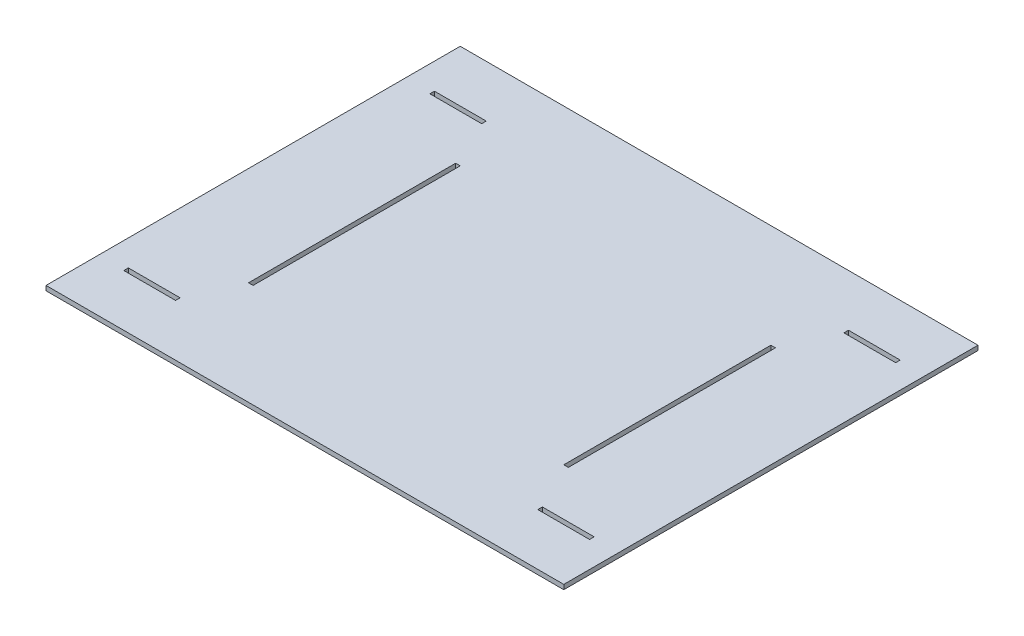
ISO-10303-21;
HEADER;
FILE_DESCRIPTION(('STEP AP214'),'2;1');
FILE_NAME('part.step','',(''),(''),'','','');
FILE_SCHEMA(('AUTOMOTIVE_DESIGN { 1 0 10303 214 1 1 1 1 }'));
ENDSEC;
DATA;
#1=APPLICATION_CONTEXT('core data for automotive mechanical design processes');
#2=APPLICATION_PROTOCOL_DEFINITION('international standard','automotive_design',2000,#1);
#3=PRODUCT_CONTEXT('',#1,'mechanical');
#4=PRODUCT('Part','Part','',(#3));
#5=PRODUCT_RELATED_PRODUCT_CATEGORY('part','',(#4));
#6=PRODUCT_DEFINITION_FORMATION('','',#4);
#7=PRODUCT_DEFINITION_CONTEXT('part definition',#1,'design');
#8=PRODUCT_DEFINITION('design','',#6,#7);
#9=PRODUCT_DEFINITION_SHAPE('','',#8);
#10=(LENGTH_UNIT() NAMED_UNIT(*) SI_UNIT(.MILLI.,.METRE.));
#11=(NAMED_UNIT(*) PLANE_ANGLE_UNIT() SI_UNIT($,.RADIAN.));
#12=(NAMED_UNIT(*) SI_UNIT($,.STERADIAN.) SOLID_ANGLE_UNIT());
#13=UNCERTAINTY_MEASURE_WITH_UNIT(LENGTH_MEASURE(1.E-05),#10,'distance_accuracy_value','');
#14=(GEOMETRIC_REPRESENTATION_CONTEXT(3) GLOBAL_UNCERTAINTY_ASSIGNED_CONTEXT((#13)) GLOBAL_UNIT_ASSIGNED_CONTEXT((#10,
#11,#12)) REPRESENTATION_CONTEXT('',''));
#15=CARTESIAN_POINT('',(0.,0.,0.));
#16=DIRECTION('',(0.,0.,1.));
#17=DIRECTION('',(1.,0.,0.));
#18=AXIS2_PLACEMENT_3D('',#15,#16,#17);
#19=CARTESIAN_POINT('',(-250.,4.5,-200.));
#20=DIRECTION('',(0.,0.,-1.));
#21=DIRECTION('',(-1.,0.,0.));
#22=AXIS2_PLACEMENT_3D('',#19,#20,#21);
#23=PLANE('',#22);
#24=DIRECTION('',(1.,0.,0.));
#25=VECTOR('',#24,1.);
#26=CARTESIAN_POINT('',(-250.,0.,-200.));
#27=LINE('',#26,#25);
#28=CARTESIAN_POINT('',(-250.,0.,-200.));
#29=VERTEX_POINT('',#28);
#30=CARTESIAN_POINT('',(250.,0.,-200.));
#31=VERTEX_POINT('',#30);
#32=EDGE_CURVE('E459',#29,#31,#27,.T.);
#33=ORIENTED_EDGE('',*,*,#32,.F.);
#34=DIRECTION('',(0.,-1.,0.));
#35=VECTOR('',#34,1.);
#36=CARTESIAN_POINT('',(-250.,4.5,-200.));
#37=LINE('',#36,#35);
#38=CARTESIAN_POINT('',(-250.,4.5,-200.));
#39=VERTEX_POINT('',#38);
#40=EDGE_CURVE('E11',#39,#29,#37,.T.);
#41=ORIENTED_EDGE('',*,*,#40,.F.);
#42=DIRECTION('',(1.,0.,0.));
#43=VECTOR('',#42,1.);
#44=CARTESIAN_POINT('',(-250.,4.5,-200.));
#45=LINE('',#44,#43);
#46=CARTESIAN_POINT('',(250.,4.5,-200.));
#47=VERTEX_POINT('',#46);
#48=EDGE_CURVE('E482',#39,#47,#45,.T.);
#49=ORIENTED_EDGE('',*,*,#48,.T.);
#50=DIRECTION('',(0.,-1.,0.));
#51=VECTOR('',#50,1.);
#52=CARTESIAN_POINT('',(250.,4.5,-200.));
#53=LINE('',#52,#51);
#54=EDGE_CURVE('E46',#47,#31,#53,.T.);
#55=ORIENTED_EDGE('',*,*,#54,.T.);
#56=EDGE_LOOP('',(#33,#41,#49,#55));
#57=FACE_BOUND('',#56,.T.);
#58=ADVANCED_FACE('F43',(#57),#23,.T.);
#59=CARTESIAN_POINT('',(-250.,4.5,-200.));
#60=DIRECTION('',(1.,0.,0.));
#61=DIRECTION('',(0.,0.,-1.));
#62=AXIS2_PLACEMENT_3D('',#59,#60,#61);
#63=PLANE('',#62);
#64=DIRECTION('',(0.,0.,1.));
#65=VECTOR('',#64,1.);
#66=CARTESIAN_POINT('',(-250.,0.,-200.));
#67=LINE('',#66,#65);
#68=CARTESIAN_POINT('',(-250.,0.,200.));
#69=VERTEX_POINT('',#68);
#70=EDGE_CURVE('E487',#29,#69,#67,.T.);
#71=ORIENTED_EDGE('',*,*,#70,.T.);
#72=DIRECTION('',(0.,-1.,0.));
#73=VECTOR('',#72,1.);
#74=CARTESIAN_POINT('',(-250.,4.5,200.));
#75=LINE('',#74,#73);
#76=CARTESIAN_POINT('',(-250.,4.5,200.));
#77=VERTEX_POINT('',#76);
#78=EDGE_CURVE('E52',#77,#69,#75,.T.);
#79=ORIENTED_EDGE('',*,*,#78,.F.);
#80=DIRECTION('',(0.,0.,1.));
#81=VECTOR('',#80,1.);
#82=CARTESIAN_POINT('',(-250.,4.5,-200.));
#83=LINE('',#82,#81);
#84=EDGE_CURVE('E494',#39,#77,#83,.T.);
#85=ORIENTED_EDGE('',*,*,#84,.F.);
#86=ORIENTED_EDGE('',*,*,#40,.T.);
#87=EDGE_LOOP('',(#71,#79,#85,#86));
#88=FACE_BOUND('',#87,.T.);
#89=ADVANCED_FACE('F529',(#88),#63,.F.);
#90=CARTESIAN_POINT('',(-250.,4.5,200.));
#91=DIRECTION('',(0.,0.,-1.));
#92=DIRECTION('',(-1.,0.,0.));
#93=AXIS2_PLACEMENT_3D('',#90,#91,#92);
#94=PLANE('',#93);
#95=DIRECTION('',(1.,0.,0.));
#96=VECTOR('',#95,1.);
#97=CARTESIAN_POINT('',(-250.,0.,200.));
#98=LINE('',#97,#96);
#99=CARTESIAN_POINT('',(250.,0.,200.));
#100=VERTEX_POINT('',#99);
#101=EDGE_CURVE('E504',#69,#100,#98,.T.);
#102=ORIENTED_EDGE('',*,*,#101,.T.);
#103=DIRECTION('',(0.,-1.,0.));
#104=VECTOR('',#103,1.);
#105=CARTESIAN_POINT('',(250.,4.5,200.));
#106=LINE('',#105,#104);
#107=CARTESIAN_POINT('',(250.,4.5,200.));
#108=VERTEX_POINT('',#107);
#109=EDGE_CURVE('E512',#108,#100,#106,.T.);
#110=ORIENTED_EDGE('',*,*,#109,.F.);
#111=DIRECTION('',(1.,0.,0.));
#112=VECTOR('',#111,1.);
#113=CARTESIAN_POINT('',(-250.,4.5,200.));
#114=LINE('',#113,#112);
#115=EDGE_CURVE('E491',#77,#108,#114,.T.);
#116=ORIENTED_EDGE('',*,*,#115,.F.);
#117=ORIENTED_EDGE('',*,*,#78,.T.);
#118=EDGE_LOOP('',(#102,#110,#116,#117));
#119=FACE_BOUND('',#118,.T.);
#120=ADVANCED_FACE('F533',(#119),#94,.F.);
#121=CARTESIAN_POINT('',(250.,4.5,-200.));
#122=DIRECTION('',(1.,0.,0.));
#123=DIRECTION('',(0.,0.,-1.));
#124=AXIS2_PLACEMENT_3D('',#121,#122,#123);
#125=PLANE('',#124);
#126=DIRECTION('',(0.,0.,1.));
#127=VECTOR('',#126,1.);
#128=CARTESIAN_POINT('',(250.,0.,-200.));
#129=LINE('',#128,#127);
#130=EDGE_CURVE('E500',#31,#100,#129,.T.);
#131=ORIENTED_EDGE('',*,*,#130,.F.);
#132=ORIENTED_EDGE('',*,*,#54,.F.);
#133=DIRECTION('',(0.,0.,1.));
#134=VECTOR('',#133,1.);
#135=CARTESIAN_POINT('',(250.,4.5,-200.));
#136=LINE('',#135,#134);
#137=EDGE_CURVE('E486',#47,#108,#136,.T.);
#138=ORIENTED_EDGE('',*,*,#137,.T.);
#139=ORIENTED_EDGE('',*,*,#109,.T.);
#140=EDGE_LOOP('',(#131,#132,#138,#139));
#141=FACE_BOUND('',#140,.T.);
#142=ADVANCED_FACE('F522',(#141),#125,.T.);
#143=CARTESIAN_POINT('',(0.,4.5,0.));
#144=DIRECTION('',(0.,-1.,0.));
#145=DIRECTION('',(0.,0.,-1.));
#146=AXIS2_PLACEMENT_3D('',#143,#144,#145);
#147=PLANE('',#146);
#148=DIRECTION('',(0.,0.,-1.));
#149=VECTOR('',#148,1.);
#150=CARTESIAN_POINT('',(224.9,4.5,150.));
#151=LINE('',#150,#149);
#152=CARTESIAN_POINT('',(224.9,4.5,150.));
#153=VERTEX_POINT('',#152);
#154=CARTESIAN_POINT('',(224.9,4.5,145.6));
#155=VERTEX_POINT('',#154);
#156=EDGE_CURVE('E250',#153,#155,#151,.T.);
#157=ORIENTED_EDGE('',*,*,#156,.F.);
#158=DIRECTION('',(1.,0.,0.));
#159=VECTOR('',#158,1.);
#160=CARTESIAN_POINT('',(224.9,4.5,150.));
#161=LINE('',#160,#159);
#162=CARTESIAN_POINT('',(174.9,4.5,150.));
#163=VERTEX_POINT('',#162);
#164=EDGE_CURVE('E242',#163,#153,#161,.T.);
#165=ORIENTED_EDGE('',*,*,#164,.F.);
#166=DIRECTION('',(0.,0.,1.));
#167=VECTOR('',#166,1.);
#168=CARTESIAN_POINT('',(174.9,4.5,150.));
#169=LINE('',#168,#167);
#170=CARTESIAN_POINT('',(174.9,4.5,145.6));
#171=VERTEX_POINT('',#170);
#172=EDGE_CURVE('E230',#171,#163,#169,.T.);
#173=ORIENTED_EDGE('',*,*,#172,.F.);
#174=DIRECTION('',(-1.,0.,0.));
#175=VECTOR('',#174,1.);
#176=CARTESIAN_POINT('',(224.9,4.5,145.6));
#177=LINE('',#176,#175);
#178=EDGE_CURVE('E60',#155,#171,#177,.T.);
#179=ORIENTED_EDGE('',*,*,#178,.F.);
#180=EDGE_LOOP('',(#157,#165,#173,#179));
#181=FACE_BOUND('',#180,.T.);
#182=DIRECTION('',(0.,0.,1.));
#183=VECTOR('',#182,1.);
#184=CARTESIAN_POINT('',(-174.9,4.5,150.));
#185=LINE('',#184,#183);
#186=CARTESIAN_POINT('',(-174.9,4.5,145.6));
#187=VERTEX_POINT('',#186);
#188=CARTESIAN_POINT('',(-174.9,4.5,150.));
#189=VERTEX_POINT('',#188);
#190=EDGE_CURVE('E256',#187,#189,#185,.T.);
#191=ORIENTED_EDGE('',*,*,#190,.T.);
#192=DIRECTION('',(-1.,0.,0.));
#193=VECTOR('',#192,1.);
#194=CARTESIAN_POINT('',(-224.9,4.5,150.));
#195=LINE('',#194,#193);
#196=CARTESIAN_POINT('',(-224.9,4.5,150.));
#197=VERTEX_POINT('',#196);
#198=EDGE_CURVE('E297',#189,#197,#195,.T.);
#199=ORIENTED_EDGE('',*,*,#198,.T.);
#200=DIRECTION('',(0.,0.,-1.));
#201=VECTOR('',#200,1.);
#202=CARTESIAN_POINT('',(-224.9,4.5,150.));
#203=LINE('',#202,#201);
#204=CARTESIAN_POINT('',(-224.9,4.5,145.6));
#205=VERTEX_POINT('',#204);
#206=EDGE_CURVE('E289',#197,#205,#203,.T.);
#207=ORIENTED_EDGE('',*,*,#206,.T.);
#208=DIRECTION('',(1.,0.,0.));
#209=VECTOR('',#208,1.);
#210=CARTESIAN_POINT('',(-224.9,4.5,145.6));
#211=LINE('',#210,#209);
#212=EDGE_CURVE('E279',#205,#187,#211,.T.);
#213=ORIENTED_EDGE('',*,*,#212,.T.);
#214=EDGE_LOOP('',(#191,#199,#207,#213));
#215=FACE_BOUND('',#214,.T.);
#216=DIRECTION('',(0.,0.,-1.));
#217=VECTOR('',#216,1.);
#218=CARTESIAN_POINT('',(174.9,4.5,-150.));
#219=LINE('',#218,#217);
#220=CARTESIAN_POINT('',(174.9,4.5,-145.6));
#221=VERTEX_POINT('',#220);
#222=CARTESIAN_POINT('',(174.9,4.5,-150.));
#223=VERTEX_POINT('',#222);
#224=EDGE_CURVE('E305',#221,#223,#219,.T.);
#225=ORIENTED_EDGE('',*,*,#224,.T.);
#226=DIRECTION('',(1.,0.,0.));
#227=VECTOR('',#226,1.);
#228=CARTESIAN_POINT('',(224.9,4.5,-150.));
#229=LINE('',#228,#227);
#230=CARTESIAN_POINT('',(224.9,4.5,-150.));
#231=VERTEX_POINT('',#230);
#232=EDGE_CURVE('E341',#223,#231,#229,.T.);
#233=ORIENTED_EDGE('',*,*,#232,.T.);
#234=DIRECTION('',(0.,0.,1.));
#235=VECTOR('',#234,1.);
#236=CARTESIAN_POINT('',(224.9,4.5,-150.));
#237=LINE('',#236,#235);
#238=CARTESIAN_POINT('',(224.9,4.5,-145.6));
#239=VERTEX_POINT('',#238);
#240=EDGE_CURVE('E333',#231,#239,#237,.T.);
#241=ORIENTED_EDGE('',*,*,#240,.T.);
#242=DIRECTION('',(-1.,0.,0.));
#243=VECTOR('',#242,1.);
#244=CARTESIAN_POINT('',(224.9,4.5,-145.6));
#245=LINE('',#244,#243);
#246=EDGE_CURVE('E323',#239,#221,#245,.T.);
#247=ORIENTED_EDGE('',*,*,#246,.T.);
#248=EDGE_LOOP('',(#225,#233,#241,#247));
#249=FACE_BOUND('',#248,.T.);
#250=DIRECTION('',(0.,0.,1.));
#251=VECTOR('',#250,1.);
#252=CARTESIAN_POINT('',(-224.9,4.5,-150.));
#253=LINE('',#252,#251);
#254=CARTESIAN_POINT('',(-224.9,4.5,-150.));
#255=VERTEX_POINT('',#254);
#256=CARTESIAN_POINT('',(-224.9,4.5,-145.6));
#257=VERTEX_POINT('',#256);
#258=EDGE_CURVE('E354',#255,#257,#253,.T.);
#259=ORIENTED_EDGE('',*,*,#258,.F.);
#260=DIRECTION('',(-1.,0.,0.));
#261=VECTOR('',#260,1.);
#262=CARTESIAN_POINT('',(-224.9,4.5,-150.));
#263=LINE('',#262,#261);
#264=CARTESIAN_POINT('',(-174.9,4.5,-150.));
#265=VERTEX_POINT('',#264);
#266=EDGE_CURVE('E358',#265,#255,#263,.T.);
#267=ORIENTED_EDGE('',*,*,#266,.F.);
#268=DIRECTION('',(0.,0.,-1.));
#269=VECTOR('',#268,1.);
#270=CARTESIAN_POINT('',(-174.9,4.5,-150.));
#271=LINE('',#270,#269);
#272=CARTESIAN_POINT('',(-174.9,4.5,-145.6));
#273=VERTEX_POINT('',#272);
#274=EDGE_CURVE('E349',#273,#265,#271,.T.);
#275=ORIENTED_EDGE('',*,*,#274,.F.);
#276=DIRECTION('',(1.,0.,0.));
#277=VECTOR('',#276,1.);
#278=CARTESIAN_POINT('',(-224.9,4.5,-145.6));
#279=LINE('',#278,#277);
#280=EDGE_CURVE('E350',#257,#273,#279,.T.);
#281=ORIENTED_EDGE('',*,*,#280,.F.);
#282=EDGE_LOOP('',(#259,#267,#275,#281));
#283=FACE_BOUND('',#282,.T.);
#284=DIRECTION('',(-1.,0.,1.1985362197658E-13));
#285=VECTOR('',#284,1.);
#286=CARTESIAN_POINT('',(154.4,4.5,-100.));
#287=LINE('',#286,#285);
#288=CARTESIAN_POINT('',(154.4,4.5,-100.));
#289=VERTEX_POINT('',#288);
#290=CARTESIAN_POINT('',(150.,4.5,-99.9999999999995));
#291=VERTEX_POINT('',#290);
#292=EDGE_CURVE('E397',#289,#291,#287,.T.);
#293=ORIENTED_EDGE('',*,*,#292,.F.);
#294=DIRECTION('',(0.,0.,1.));
#295=VECTOR('',#294,1.);
#296=CARTESIAN_POINT('',(154.4,4.5,-100.));
#297=LINE('',#296,#295);
#298=CARTESIAN_POINT('',(154.4,4.5,100.));
#299=VERTEX_POINT('',#298);
#300=EDGE_CURVE('E430',#289,#299,#297,.T.);
#301=ORIENTED_EDGE('',*,*,#300,.T.);
#302=DIRECTION('',(-1.,0.,1.1985362197658E-13));
#303=VECTOR('',#302,1.);
#304=CARTESIAN_POINT('',(154.4,4.5,100.));
#305=LINE('',#304,#303);
#306=CARTESIAN_POINT('',(150.,4.5,100.000000000001));
#307=VERTEX_POINT('',#306);
#308=EDGE_CURVE('E422',#299,#307,#305,.T.);
#309=ORIENTED_EDGE('',*,*,#308,.T.);
#310=DIRECTION('',(0.,0.,1.));
#311=VECTOR('',#310,1.);
#312=CARTESIAN_POINT('',(150.,4.5,-99.9999999999995));
#313=LINE('',#312,#311);
#314=EDGE_CURVE('E415',#291,#307,#313,.T.);
#315=ORIENTED_EDGE('',*,*,#314,.F.);
#316=EDGE_LOOP('',(#293,#301,#309,#315));
#317=FACE_BOUND('',#316,.T.);
#318=DIRECTION('',(1.,0.,1.1985362197658E-13));
#319=VECTOR('',#318,1.);
#320=CARTESIAN_POINT('',(-154.4,4.5,100.));
#321=LINE('',#320,#319);
#322=CARTESIAN_POINT('',(-154.4,4.5,100.));
#323=VERTEX_POINT('',#322);
#324=CARTESIAN_POINT('',(-150.,4.5,100.000000000001));
#325=VERTEX_POINT('',#324);
#326=EDGE_CURVE('E443',#323,#325,#321,.T.);
#327=ORIENTED_EDGE('',*,*,#326,.F.);
#328=DIRECTION('',(0.,0.,1.));
#329=VECTOR('',#328,1.);
#330=CARTESIAN_POINT('',(-154.4,4.5,-100.));
#331=LINE('',#330,#329);
#332=CARTESIAN_POINT('',(-154.4,4.5,-100.));
#333=VERTEX_POINT('',#332);
#334=EDGE_CURVE('E439',#333,#323,#331,.T.);
#335=ORIENTED_EDGE('',*,*,#334,.F.);
#336=DIRECTION('',(1.,0.,1.1985362197658E-13));
#337=VECTOR('',#336,1.);
#338=CARTESIAN_POINT('',(-154.4,4.5,-100.));
#339=LINE('',#338,#337);
#340=CARTESIAN_POINT('',(-150.,4.5,-99.9999999999995));
#341=VERTEX_POINT('',#340);
#342=EDGE_CURVE('E455',#333,#341,#339,.T.);
#343=ORIENTED_EDGE('',*,*,#342,.T.);
#344=DIRECTION('',(0.,0.,1.));
#345=VECTOR('',#344,1.);
#346=CARTESIAN_POINT('',(-150.,4.5,-99.9999999999995));
#347=LINE('',#346,#345);
#348=EDGE_CURVE('E449',#341,#325,#347,.T.);
#349=ORIENTED_EDGE('',*,*,#348,.T.);
#350=EDGE_LOOP('',(#327,#335,#343,#349));
#351=FACE_BOUND('',#350,.T.);
#352=ORIENTED_EDGE('',*,*,#48,.F.);
#353=ORIENTED_EDGE('',*,*,#84,.T.);
#354=ORIENTED_EDGE('',*,*,#115,.T.);
#355=ORIENTED_EDGE('',*,*,#137,.F.);
#356=EDGE_LOOP('',(#352,#353,#354,#355));
#357=FACE_BOUND('',#356,.T.);
#358=ADVANCED_FACE('F247',(#181,#215,#249,#283,#317,#351,#357),#147,.F.);
#359=CARTESIAN_POINT('',(0.,0.,0.));
#360=DIRECTION('',(0.,-1.,0.));
#361=DIRECTION('',(0.,0.,-1.));
#362=AXIS2_PLACEMENT_3D('',#359,#360,#361);
#363=PLANE('',#362);
#364=DIRECTION('',(1.,0.,0.));
#365=VECTOR('',#364,1.);
#366=CARTESIAN_POINT('',(224.9,0.,150.));
#367=LINE('',#366,#365);
#368=CARTESIAN_POINT('',(174.9,0.,150.));
#369=VERTEX_POINT('',#368);
#370=CARTESIAN_POINT('',(224.9,0.,150.));
#371=VERTEX_POINT('',#370);
#372=EDGE_CURVE('E68',#369,#371,#367,.T.);
#373=ORIENTED_EDGE('',*,*,#372,.T.);
#374=DIRECTION('',(0.,0.,-1.));
#375=VECTOR('',#374,1.);
#376=CARTESIAN_POINT('',(224.9,0.,150.));
#377=LINE('',#376,#375);
#378=CARTESIAN_POINT('',(224.9,0.,145.6));
#379=VERTEX_POINT('',#378);
#380=EDGE_CURVE('E252',#371,#379,#377,.T.);
#381=ORIENTED_EDGE('',*,*,#380,.T.);
#382=DIRECTION('',(-1.,0.,0.));
#383=VECTOR('',#382,1.);
#384=CARTESIAN_POINT('',(224.9,0.,145.6));
#385=LINE('',#384,#383);
#386=CARTESIAN_POINT('',(174.9,0.,145.6));
#387=VERTEX_POINT('',#386);
#388=EDGE_CURVE('E879',#379,#387,#385,.T.);
#389=ORIENTED_EDGE('',*,*,#388,.T.);
#390=DIRECTION('',(0.,0.,1.));
#391=VECTOR('',#390,1.);
#392=CARTESIAN_POINT('',(174.9,0.,150.));
#393=LINE('',#392,#391);
#394=EDGE_CURVE('E238',#387,#369,#393,.T.);
#395=ORIENTED_EDGE('',*,*,#394,.T.);
#396=EDGE_LOOP('',(#373,#381,#389,#395));
#397=FACE_BOUND('',#396,.T.);
#398=DIRECTION('',(-1.,0.,0.));
#399=VECTOR('',#398,1.);
#400=CARTESIAN_POINT('',(-224.9,0.,150.));
#401=LINE('',#400,#399);
#402=CARTESIAN_POINT('',(-174.9,0.,150.));
#403=VERTEX_POINT('',#402);
#404=CARTESIAN_POINT('',(-224.9,0.,150.));
#405=VERTEX_POINT('',#404);
#406=EDGE_CURVE('E301',#403,#405,#401,.T.);
#407=ORIENTED_EDGE('',*,*,#406,.F.);
#408=DIRECTION('',(0.,0.,1.));
#409=VECTOR('',#408,1.);
#410=CARTESIAN_POINT('',(-174.9,0.,150.));
#411=LINE('',#410,#409);
#412=CARTESIAN_POINT('',(-174.9,0.,145.6));
#413=VERTEX_POINT('',#412);
#414=EDGE_CURVE('E265',#413,#403,#411,.T.);
#415=ORIENTED_EDGE('',*,*,#414,.F.);
#416=DIRECTION('',(1.,0.,0.));
#417=VECTOR('',#416,1.);
#418=CARTESIAN_POINT('',(-224.9,0.,145.6));
#419=LINE('',#418,#417);
#420=CARTESIAN_POINT('',(-224.9,0.,145.6));
#421=VERTEX_POINT('',#420);
#422=EDGE_CURVE('E283',#421,#413,#419,.T.);
#423=ORIENTED_EDGE('',*,*,#422,.F.);
#424=DIRECTION('',(0.,0.,-1.));
#425=VECTOR('',#424,1.);
#426=CARTESIAN_POINT('',(-224.9,0.,150.));
#427=LINE('',#426,#425);
#428=EDGE_CURVE('E293',#405,#421,#427,.T.);
#429=ORIENTED_EDGE('',*,*,#428,.F.);
#430=EDGE_LOOP('',(#407,#415,#423,#429));
#431=FACE_BOUND('',#430,.T.);
#432=DIRECTION('',(1.,0.,0.));
#433=VECTOR('',#432,1.);
#434=CARTESIAN_POINT('',(224.9,0.,-150.));
#435=LINE('',#434,#433);
#436=CARTESIAN_POINT('',(174.9,0.,-150.));
#437=VERTEX_POINT('',#436);
#438=CARTESIAN_POINT('',(224.9,0.,-150.));
#439=VERTEX_POINT('',#438);
#440=EDGE_CURVE('E345',#437,#439,#435,.T.);
#441=ORIENTED_EDGE('',*,*,#440,.F.);
#442=DIRECTION('',(0.,0.,-1.));
#443=VECTOR('',#442,1.);
#444=CARTESIAN_POINT('',(174.9,0.,-150.));
#445=LINE('',#444,#443);
#446=CARTESIAN_POINT('',(174.9,0.,-145.6));
#447=VERTEX_POINT('',#446);
#448=EDGE_CURVE('E309',#447,#437,#445,.T.);
#449=ORIENTED_EDGE('',*,*,#448,.F.);
#450=DIRECTION('',(-1.,0.,0.));
#451=VECTOR('',#450,1.);
#452=CARTESIAN_POINT('',(224.9,0.,-145.6));
#453=LINE('',#452,#451);
#454=CARTESIAN_POINT('',(224.9,0.,-145.6));
#455=VERTEX_POINT('',#454);
#456=EDGE_CURVE('E327',#455,#447,#453,.T.);
#457=ORIENTED_EDGE('',*,*,#456,.F.);
#458=DIRECTION('',(0.,0.,1.));
#459=VECTOR('',#458,1.);
#460=CARTESIAN_POINT('',(224.9,0.,-150.));
#461=LINE('',#460,#459);
#462=EDGE_CURVE('E337',#439,#455,#461,.T.);
#463=ORIENTED_EDGE('',*,*,#462,.F.);
#464=EDGE_LOOP('',(#441,#449,#457,#463));
#465=FACE_BOUND('',#464,.T.);
#466=DIRECTION('',(-1.,0.,0.));
#467=VECTOR('',#466,1.);
#468=CARTESIAN_POINT('',(-224.9,0.,-150.));
#469=LINE('',#468,#467);
#470=CARTESIAN_POINT('',(-174.9,0.,-150.));
#471=VERTEX_POINT('',#470);
#472=CARTESIAN_POINT('',(-224.9,0.,-150.));
#473=VERTEX_POINT('',#472);
#474=EDGE_CURVE('E353',#471,#473,#469,.T.);
#475=ORIENTED_EDGE('',*,*,#474,.T.);
#476=DIRECTION('',(0.,0.,1.));
#477=VECTOR('',#476,1.);
#478=CARTESIAN_POINT('',(-224.9,0.,-150.));
#479=LINE('',#478,#477);
#480=CARTESIAN_POINT('',(-224.9,0.,-145.6));
#481=VERTEX_POINT('',#480);
#482=EDGE_CURVE('E380',#473,#481,#479,.T.);
#483=ORIENTED_EDGE('',*,*,#482,.T.);
#484=DIRECTION('',(1.,0.,0.));
#485=VECTOR('',#484,1.);
#486=CARTESIAN_POINT('',(-224.9,0.,-145.6));
#487=LINE('',#486,#485);
#488=CARTESIAN_POINT('',(-174.9,0.,-145.6));
#489=VERTEX_POINT('',#488);
#490=EDGE_CURVE('E375',#481,#489,#487,.T.);
#491=ORIENTED_EDGE('',*,*,#490,.T.);
#492=DIRECTION('',(0.,0.,-1.));
#493=VECTOR('',#492,1.);
#494=CARTESIAN_POINT('',(-174.9,0.,-150.));
#495=LINE('',#494,#493);
#496=EDGE_CURVE('E369',#489,#471,#495,.T.);
#497=ORIENTED_EDGE('',*,*,#496,.T.);
#498=EDGE_LOOP('',(#475,#483,#491,#497));
#499=FACE_BOUND('',#498,.T.);
#500=DIRECTION('',(0.,0.,1.));
#501=VECTOR('',#500,1.);
#502=CARTESIAN_POINT('',(154.4,0.,-100.));
#503=LINE('',#502,#501);
#504=CARTESIAN_POINT('',(154.4,0.,-100.));
#505=VERTEX_POINT('',#504);
#506=CARTESIAN_POINT('',(154.4,0.,100.));
#507=VERTEX_POINT('',#506);
#508=EDGE_CURVE('E434',#505,#507,#503,.T.);
#509=ORIENTED_EDGE('',*,*,#508,.F.);
#510=DIRECTION('',(-1.,0.,1.1985362197658E-13));
#511=VECTOR('',#510,1.);
#512=CARTESIAN_POINT('',(154.4,0.,-100.));
#513=LINE('',#512,#511);
#514=CARTESIAN_POINT('',(150.,0.,-99.9999999999995));
#515=VERTEX_POINT('',#514);
#516=EDGE_CURVE('E393',#505,#515,#513,.T.);
#517=ORIENTED_EDGE('',*,*,#516,.T.);
#518=DIRECTION('',(0.,0.,1.));
#519=VECTOR('',#518,1.);
#520=CARTESIAN_POINT('',(150.,0.,-99.9999999999995));
#521=LINE('',#520,#519);
#522=CARTESIAN_POINT('',(150.,0.,100.000000000001));
#523=VERTEX_POINT('',#522);
#524=EDGE_CURVE('E408',#515,#523,#521,.T.);
#525=ORIENTED_EDGE('',*,*,#524,.T.);
#526=DIRECTION('',(-1.,0.,1.1985362197658E-13));
#527=VECTOR('',#526,1.);
#528=CARTESIAN_POINT('',(154.4,0.,100.));
#529=LINE('',#528,#527);
#530=EDGE_CURVE('E426',#507,#523,#529,.T.);
#531=ORIENTED_EDGE('',*,*,#530,.F.);
#532=EDGE_LOOP('',(#509,#517,#525,#531));
#533=FACE_BOUND('',#532,.T.);
#534=DIRECTION('',(0.,0.,1.));
#535=VECTOR('',#534,1.);
#536=CARTESIAN_POINT('',(-154.4,0.,-100.));
#537=LINE('',#536,#535);
#538=CARTESIAN_POINT('',(-154.4,0.,-100.));
#539=VERTEX_POINT('',#538);
#540=CARTESIAN_POINT('',(-154.4,0.,100.));
#541=VERTEX_POINT('',#540);
#542=EDGE_CURVE('E448',#539,#541,#537,.T.);
#543=ORIENTED_EDGE('',*,*,#542,.T.);
#544=DIRECTION('',(1.,0.,1.1985362197658E-13));
#545=VECTOR('',#544,1.);
#546=CARTESIAN_POINT('',(-154.4,0.,100.));
#547=LINE('',#546,#545);
#548=CARTESIAN_POINT('',(-150.,0.,100.000000000001));
#549=VERTEX_POINT('',#548);
#550=EDGE_CURVE('E468',#541,#549,#547,.T.);
#551=ORIENTED_EDGE('',*,*,#550,.T.);
#552=DIRECTION('',(0.,0.,1.));
#553=VECTOR('',#552,1.);
#554=CARTESIAN_POINT('',(-150.,0.,-99.9999999999995));
#555=LINE('',#554,#553);
#556=CARTESIAN_POINT('',(-150.,0.,-99.9999999999995));
#557=VERTEX_POINT('',#556);
#558=EDGE_CURVE('E444',#557,#549,#555,.T.);
#559=ORIENTED_EDGE('',*,*,#558,.F.);
#560=DIRECTION('',(1.,0.,1.1985362197658E-13));
#561=VECTOR('',#560,1.);
#562=CARTESIAN_POINT('',(-154.4,0.,-100.));
#563=LINE('',#562,#561);
#564=EDGE_CURVE('E438',#539,#557,#563,.T.);
#565=ORIENTED_EDGE('',*,*,#564,.F.);
#566=EDGE_LOOP('',(#543,#551,#559,#565));
#567=FACE_BOUND('',#566,.T.);
#568=ORIENTED_EDGE('',*,*,#32,.T.);
#569=ORIENTED_EDGE('',*,*,#130,.T.);
#570=ORIENTED_EDGE('',*,*,#101,.F.);
#571=ORIENTED_EDGE('',*,*,#70,.F.);
#572=EDGE_LOOP('',(#568,#569,#570,#571));
#573=FACE_BOUND('',#572,.T.);
#574=ADVANCED_FACE('F526',(#397,#431,#465,#499,#533,#567,#573),#363,.T.);
#575=CARTESIAN_POINT('',(-154.4,-200.048394145017,-100.));
#576=DIRECTION('',(-1.,0.,0.));
#577=DIRECTION('',(0.,0.,1.));
#578=AXIS2_PLACEMENT_3D('',#575,#576,#577);
#579=PLANE('',#578);
#580=DIRECTION('',(0.,1.,0.));
#581=VECTOR('',#580,1.);
#582=CARTESIAN_POINT('',(-154.4,-200.048394145017,-100.));
#583=LINE('',#582,#581);
#584=EDGE_CURVE('E453',#539,#333,#583,.T.);
#585=ORIENTED_EDGE('',*,*,#584,.T.);
#586=ORIENTED_EDGE('',*,*,#334,.T.);
#587=DIRECTION('',(0.,1.,0.));
#588=VECTOR('',#587,1.);
#589=CARTESIAN_POINT('',(-154.4,-200.048394145017,100.));
#590=LINE('',#589,#588);
#591=EDGE_CURVE('E463',#541,#323,#590,.T.);
#592=ORIENTED_EDGE('',*,*,#591,.F.);
#593=ORIENTED_EDGE('',*,*,#542,.F.);
#594=EDGE_LOOP('',(#585,#586,#592,#593));
#595=FACE_BOUND('',#594,.T.);
#596=ADVANCED_FACE('F541',(#595),#579,.F.);
#597=CARTESIAN_POINT('',(-154.4,-200.048394145017,100.));
#598=DIRECTION('',(-1.1985362197658E-13,0.,1.));
#599=DIRECTION('',(1.,0.,1.1985362197658E-13));
#600=AXIS2_PLACEMENT_3D('',#597,#598,#599);
#601=PLANE('',#600);
#602=ORIENTED_EDGE('',*,*,#591,.T.);
#603=ORIENTED_EDGE('',*,*,#326,.T.);
#604=DIRECTION('',(0.,1.,0.));
#605=VECTOR('',#604,1.);
#606=CARTESIAN_POINT('',(-150.,-200.048394145017,100.000000000001));
#607=LINE('',#606,#605);
#608=EDGE_CURVE('E472',#549,#325,#607,.T.);
#609=ORIENTED_EDGE('',*,*,#608,.F.);
#610=ORIENTED_EDGE('',*,*,#550,.F.);
#611=EDGE_LOOP('',(#602,#603,#609,#610));
#612=FACE_BOUND('',#611,.T.);
#613=ADVANCED_FACE('F571',(#612),#601,.F.);
#614=CARTESIAN_POINT('',(-150.,-200.048394145017,-99.9999999999995));
#615=DIRECTION('',(-1.,0.,0.));
#616=DIRECTION('',(0.,0.,1.));
#617=AXIS2_PLACEMENT_3D('',#614,#615,#616);
#618=PLANE('',#617);
#619=ORIENTED_EDGE('',*,*,#558,.T.);
#620=ORIENTED_EDGE('',*,*,#608,.T.);
#621=ORIENTED_EDGE('',*,*,#348,.F.);
#622=DIRECTION('',(0.,1.,0.));
#623=VECTOR('',#622,1.);
#624=CARTESIAN_POINT('',(-150.,-200.048394145017,-99.9999999999995));
#625=LINE('',#624,#623);
#626=EDGE_CURVE('E454',#557,#341,#625,.T.);
#627=ORIENTED_EDGE('',*,*,#626,.F.);
#628=EDGE_LOOP('',(#619,#620,#621,#627));
#629=FACE_BOUND('',#628,.T.);
#630=ADVANCED_FACE('F582',(#629),#618,.T.);
#631=CARTESIAN_POINT('',(-154.4,-200.048394145017,-100.));
#632=DIRECTION('',(-1.1985362197658E-13,0.,1.));
#633=DIRECTION('',(1.,0.,1.1985362197658E-13));
#634=AXIS2_PLACEMENT_3D('',#631,#632,#633);
#635=PLANE('',#634);
#636=ORIENTED_EDGE('',*,*,#564,.T.);
#637=ORIENTED_EDGE('',*,*,#626,.T.);
#638=ORIENTED_EDGE('',*,*,#342,.F.);
#639=ORIENTED_EDGE('',*,*,#584,.F.);
#640=EDGE_LOOP('',(#636,#637,#638,#639));
#641=FACE_BOUND('',#640,.T.);
#642=ADVANCED_FACE('F593',(#641),#635,.T.);
#643=CARTESIAN_POINT('',(154.4,-200.048394145017,-100.));
#644=DIRECTION('',(1.,0.,0.));
#645=DIRECTION('',(0.,0.,1.));
#646=AXIS2_PLACEMENT_3D('',#643,#644,#645);
#647=PLANE('',#646);
#648=DIRECTION('',(0.,1.,0.));
#649=VECTOR('',#648,1.);
#650=CARTESIAN_POINT('',(154.4,-200.048394145017,-100.));
#651=LINE('',#650,#649);
#652=EDGE_CURVE('E404',#505,#289,#651,.T.);
#653=ORIENTED_EDGE('',*,*,#652,.F.);
#654=ORIENTED_EDGE('',*,*,#508,.T.);
#655=DIRECTION('',(0.,1.,0.));
#656=VECTOR('',#655,1.);
#657=CARTESIAN_POINT('',(154.4,-200.048394145017,100.));
#658=LINE('',#657,#656);
#659=EDGE_CURVE('E419',#507,#299,#658,.T.);
#660=ORIENTED_EDGE('',*,*,#659,.T.);
#661=ORIENTED_EDGE('',*,*,#300,.F.);
#662=EDGE_LOOP('',(#653,#654,#660,#661));
#663=FACE_BOUND('',#662,.T.);
#664=ADVANCED_FACE('F604',(#663),#647,.F.);
#665=CARTESIAN_POINT('',(154.4,-200.048394145017,100.));
#666=DIRECTION('',(1.1985362197658E-13,0.,1.));
#667=DIRECTION('',(-1.,0.,1.1985362197658E-13));
#668=AXIS2_PLACEMENT_3D('',#665,#666,#667);
#669=PLANE('',#668);
#670=ORIENTED_EDGE('',*,*,#659,.F.);
#671=ORIENTED_EDGE('',*,*,#530,.T.);
#672=DIRECTION('',(0.,1.,0.));
#673=VECTOR('',#672,1.);
#674=CARTESIAN_POINT('',(150.,-200.048394145017,100.000000000001));
#675=LINE('',#674,#673);
#676=EDGE_CURVE('E412',#523,#307,#675,.T.);
#677=ORIENTED_EDGE('',*,*,#676,.T.);
#678=ORIENTED_EDGE('',*,*,#308,.F.);
#679=EDGE_LOOP('',(#670,#671,#677,#678));
#680=FACE_BOUND('',#679,.T.);
#681=ADVANCED_FACE('F615',(#680),#669,.F.);
#682=CARTESIAN_POINT('',(150.,-200.048394145017,-99.9999999999995));
#683=DIRECTION('',(1.,0.,0.));
#684=DIRECTION('',(0.,0.,1.));
#685=AXIS2_PLACEMENT_3D('',#682,#683,#684);
#686=PLANE('',#685);
#687=ORIENTED_EDGE('',*,*,#524,.F.);
#688=DIRECTION('',(0.,1.,0.));
#689=VECTOR('',#688,1.);
#690=CARTESIAN_POINT('',(150.,-200.048394145017,-99.9999999999995));
#691=LINE('',#690,#689);
#692=EDGE_CURVE('E401',#515,#291,#691,.T.);
#693=ORIENTED_EDGE('',*,*,#692,.T.);
#694=ORIENTED_EDGE('',*,*,#314,.T.);
#695=ORIENTED_EDGE('',*,*,#676,.F.);
#696=EDGE_LOOP('',(#687,#693,#694,#695));
#697=FACE_BOUND('',#696,.T.);
#698=ADVANCED_FACE('F626',(#697),#686,.T.);
#699=CARTESIAN_POINT('',(154.4,-200.048394145017,-100.));
#700=DIRECTION('',(1.1985362197658E-13,0.,1.));
#701=DIRECTION('',(-1.,0.,1.1985362197658E-13));
#702=AXIS2_PLACEMENT_3D('',#699,#700,#701);
#703=PLANE('',#702);
#704=ORIENTED_EDGE('',*,*,#516,.F.);
#705=ORIENTED_EDGE('',*,*,#652,.T.);
#706=ORIENTED_EDGE('',*,*,#292,.T.);
#707=ORIENTED_EDGE('',*,*,#692,.F.);
#708=EDGE_LOOP('',(#704,#705,#706,#707));
#709=FACE_BOUND('',#708,.T.);
#710=ADVANCED_FACE('F637',(#709),#703,.T.);
#711=CARTESIAN_POINT('',(-224.9,-50.1932266346765,-150.));
#712=DIRECTION('',(0.,0.,-1.));
#713=DIRECTION('',(-1.,0.,0.));
#714=AXIS2_PLACEMENT_3D('',#711,#712,#713);
#715=PLANE('',#714);
#716=DIRECTION('',(0.,1.,0.));
#717=VECTOR('',#716,1.);
#718=CARTESIAN_POINT('',(-174.9,-50.1932266346765,-150.));
#719=LINE('',#718,#717);
#720=EDGE_CURVE('E373',#471,#265,#719,.T.);
#721=ORIENTED_EDGE('',*,*,#720,.T.);
#722=ORIENTED_EDGE('',*,*,#266,.T.);
#723=DIRECTION('',(0.,1.,0.));
#724=VECTOR('',#723,1.);
#725=CARTESIAN_POINT('',(-224.9,-50.1932266346765,-150.));
#726=LINE('',#725,#724);
#727=EDGE_CURVE('E368',#473,#255,#726,.T.);
#728=ORIENTED_EDGE('',*,*,#727,.F.);
#729=ORIENTED_EDGE('',*,*,#474,.F.);
#730=EDGE_LOOP('',(#721,#722,#728,#729));
#731=FACE_BOUND('',#730,.T.);
#732=ADVANCED_FACE('F648',(#731),#715,.F.);
#733=CARTESIAN_POINT('',(-224.9,-50.1932266346765,-150.));
#734=DIRECTION('',(-1.,0.,0.));
#735=DIRECTION('',(0.,0.,1.));
#736=AXIS2_PLACEMENT_3D('',#733,#734,#735);
#737=PLANE('',#736);
#738=ORIENTED_EDGE('',*,*,#727,.T.);
#739=ORIENTED_EDGE('',*,*,#258,.T.);
#740=DIRECTION('',(0.,1.,0.));
#741=VECTOR('',#740,1.);
#742=CARTESIAN_POINT('',(-224.9,-50.1932266346765,-145.6));
#743=LINE('',#742,#741);
#744=EDGE_CURVE('E379',#481,#257,#743,.T.);
#745=ORIENTED_EDGE('',*,*,#744,.F.);
#746=ORIENTED_EDGE('',*,*,#482,.F.);
#747=EDGE_LOOP('',(#738,#739,#745,#746));
#748=FACE_BOUND('',#747,.T.);
#749=ADVANCED_FACE('F659',(#748),#737,.F.);
#750=CARTESIAN_POINT('',(-224.9,-50.1932266346765,-145.6));
#751=DIRECTION('',(0.,0.,1.));
#752=DIRECTION('',(1.,0.,0.));
#753=AXIS2_PLACEMENT_3D('',#750,#751,#752);
#754=PLANE('',#753);
#755=ORIENTED_EDGE('',*,*,#744,.T.);
#756=ORIENTED_EDGE('',*,*,#280,.T.);
#757=DIRECTION('',(0.,1.,0.));
#758=VECTOR('',#757,1.);
#759=CARTESIAN_POINT('',(-174.9,-50.1932266346765,-145.6));
#760=LINE('',#759,#758);
#761=EDGE_CURVE('E374',#489,#273,#760,.T.);
#762=ORIENTED_EDGE('',*,*,#761,.F.);
#763=ORIENTED_EDGE('',*,*,#490,.F.);
#764=EDGE_LOOP('',(#755,#756,#762,#763));
#765=FACE_BOUND('',#764,.T.);
#766=ADVANCED_FACE('F670',(#765),#754,.F.);
#767=CARTESIAN_POINT('',(-174.9,-50.1932266346765,-150.));
#768=DIRECTION('',(1.,0.,0.));
#769=DIRECTION('',(0.,0.,-1.));
#770=AXIS2_PLACEMENT_3D('',#767,#768,#769);
#771=PLANE('',#770);
#772=ORIENTED_EDGE('',*,*,#761,.T.);
#773=ORIENTED_EDGE('',*,*,#274,.T.);
#774=ORIENTED_EDGE('',*,*,#720,.F.);
#775=ORIENTED_EDGE('',*,*,#496,.F.);
#776=EDGE_LOOP('',(#772,#773,#774,#775));
#777=FACE_BOUND('',#776,.T.);
#778=ADVANCED_FACE('F681',(#777),#771,.F.);
#779=CARTESIAN_POINT('',(224.9,-50.1932266346765,-150.));
#780=DIRECTION('',(0.,0.,-1.));
#781=DIRECTION('',(1.,0.,0.));
#782=AXIS2_PLACEMENT_3D('',#779,#780,#781);
#783=PLANE('',#782);
#784=DIRECTION('',(0.,1.,0.));
#785=VECTOR('',#784,1.);
#786=CARTESIAN_POINT('',(174.9,-50.1932266346765,-150.));
#787=LINE('',#786,#785);
#788=EDGE_CURVE('E316',#437,#223,#787,.T.);
#789=ORIENTED_EDGE('',*,*,#788,.F.);
#790=ORIENTED_EDGE('',*,*,#440,.T.);
#791=DIRECTION('',(0.,1.,0.));
#792=VECTOR('',#791,1.);
#793=CARTESIAN_POINT('',(224.9,-50.1932266346765,-150.));
#794=LINE('',#793,#792);
#795=EDGE_CURVE('E330',#439,#231,#794,.T.);
#796=ORIENTED_EDGE('',*,*,#795,.T.);
#797=ORIENTED_EDGE('',*,*,#232,.F.);
#798=EDGE_LOOP('',(#789,#790,#796,#797));
#799=FACE_BOUND('',#798,.T.);
#800=ADVANCED_FACE('F691',(#799),#783,.F.);
#801=CARTESIAN_POINT('',(224.9,-50.1932266346765,-150.));
#802=DIRECTION('',(1.,0.,0.));
#803=DIRECTION('',(0.,0.,1.));
#804=AXIS2_PLACEMENT_3D('',#801,#802,#803);
#805=PLANE('',#804);
#806=ORIENTED_EDGE('',*,*,#795,.F.);
#807=ORIENTED_EDGE('',*,*,#462,.T.);
#808=DIRECTION('',(0.,1.,0.));
#809=VECTOR('',#808,1.);
#810=CARTESIAN_POINT('',(224.9,-50.1932266346765,-145.6));
#811=LINE('',#810,#809);
#812=EDGE_CURVE('E320',#455,#239,#811,.T.);
#813=ORIENTED_EDGE('',*,*,#812,.T.);
#814=ORIENTED_EDGE('',*,*,#240,.F.);
#815=EDGE_LOOP('',(#806,#807,#813,#814));
#816=FACE_BOUND('',#815,.T.);
#817=ADVANCED_FACE('F713',(#816),#805,.F.);
#818=CARTESIAN_POINT('',(224.9,-50.1932266346765,-145.6));
#819=DIRECTION('',(0.,0.,1.));
#820=DIRECTION('',(-1.,0.,0.));
#821=AXIS2_PLACEMENT_3D('',#818,#819,#820);
#822=PLANE('',#821);
#823=ORIENTED_EDGE('',*,*,#812,.F.);
#824=ORIENTED_EDGE('',*,*,#456,.T.);
#825=DIRECTION('',(0.,1.,0.));
#826=VECTOR('',#825,1.);
#827=CARTESIAN_POINT('',(174.9,-50.1932266346765,-145.6));
#828=LINE('',#827,#826);
#829=EDGE_CURVE('E313',#447,#221,#828,.T.);
#830=ORIENTED_EDGE('',*,*,#829,.T.);
#831=ORIENTED_EDGE('',*,*,#246,.F.);
#832=EDGE_LOOP('',(#823,#824,#830,#831));
#833=FACE_BOUND('',#832,.T.);
#834=ADVANCED_FACE('F724',(#833),#822,.F.);
#835=CARTESIAN_POINT('',(174.9,-50.1932266346765,-150.));
#836=DIRECTION('',(-1.,0.,0.));
#837=DIRECTION('',(0.,0.,-1.));
#838=AXIS2_PLACEMENT_3D('',#835,#836,#837);
#839=PLANE('',#838);
#840=ORIENTED_EDGE('',*,*,#829,.F.);
#841=ORIENTED_EDGE('',*,*,#448,.T.);
#842=ORIENTED_EDGE('',*,*,#788,.T.);
#843=ORIENTED_EDGE('',*,*,#224,.F.);
#844=EDGE_LOOP('',(#840,#841,#842,#843));
#845=FACE_BOUND('',#844,.T.);
#846=ADVANCED_FACE('F735',(#845),#839,.F.);
#847=CARTESIAN_POINT('',(-224.9,-50.1932266346765,150.));
#848=DIRECTION('',(0.,0.,1.));
#849=DIRECTION('',(-1.,0.,0.));
#850=AXIS2_PLACEMENT_3D('',#847,#848,#849);
#851=PLANE('',#850);
#852=DIRECTION('',(0.,1.,0.));
#853=VECTOR('',#852,1.);
#854=CARTESIAN_POINT('',(-174.9,-50.1932266346765,150.));
#855=LINE('',#854,#853);
#856=EDGE_CURVE('E272',#403,#189,#855,.T.);
#857=ORIENTED_EDGE('',*,*,#856,.F.);
#858=ORIENTED_EDGE('',*,*,#406,.T.);
#859=DIRECTION('',(0.,1.,0.));
#860=VECTOR('',#859,1.);
#861=CARTESIAN_POINT('',(-224.9,-50.1932266346765,150.));
#862=LINE('',#861,#860);
#863=EDGE_CURVE('E286',#405,#197,#862,.T.);
#864=ORIENTED_EDGE('',*,*,#863,.T.);
#865=ORIENTED_EDGE('',*,*,#198,.F.);
#866=EDGE_LOOP('',(#857,#858,#864,#865));
#867=FACE_BOUND('',#866,.T.);
#868=ADVANCED_FACE('F746',(#867),#851,.F.);
#869=CARTESIAN_POINT('',(-224.9,-50.1932266346765,150.));
#870=DIRECTION('',(-1.,0.,0.));
#871=DIRECTION('',(0.,0.,-1.));
#872=AXIS2_PLACEMENT_3D('',#869,#870,#871);
#873=PLANE('',#872);
#874=ORIENTED_EDGE('',*,*,#863,.F.);
#875=ORIENTED_EDGE('',*,*,#428,.T.);
#876=DIRECTION('',(0.,1.,0.));
#877=VECTOR('',#876,1.);
#878=CARTESIAN_POINT('',(-224.9,-50.1932266346765,145.6));
#879=LINE('',#878,#877);
#880=EDGE_CURVE('E276',#421,#205,#879,.T.);
#881=ORIENTED_EDGE('',*,*,#880,.T.);
#882=ORIENTED_EDGE('',*,*,#206,.F.);
#883=EDGE_LOOP('',(#874,#875,#881,#882));
#884=FACE_BOUND('',#883,.T.);
#885=ADVANCED_FACE('F757',(#884),#873,.F.);
#886=CARTESIAN_POINT('',(-224.9,-50.1932266346765,145.6));
#887=DIRECTION('',(0.,0.,-1.));
#888=DIRECTION('',(1.,0.,0.));
#889=AXIS2_PLACEMENT_3D('',#886,#887,#888);
#890=PLANE('',#889);
#891=ORIENTED_EDGE('',*,*,#880,.F.);
#892=ORIENTED_EDGE('',*,*,#422,.T.);
#893=DIRECTION('',(0.,1.,0.));
#894=VECTOR('',#893,1.);
#895=CARTESIAN_POINT('',(-174.9,-50.1932266346765,145.6));
#896=LINE('',#895,#894);
#897=EDGE_CURVE('E269',#413,#187,#896,.T.);
#898=ORIENTED_EDGE('',*,*,#897,.T.);
#899=ORIENTED_EDGE('',*,*,#212,.F.);
#900=EDGE_LOOP('',(#891,#892,#898,#899));
#901=FACE_BOUND('',#900,.T.);
#902=ADVANCED_FACE('F768',(#901),#890,.F.);
#903=CARTESIAN_POINT('',(-174.9,-50.1932266346765,150.));
#904=DIRECTION('',(1.,0.,0.));
#905=DIRECTION('',(0.,0.,1.));
#906=AXIS2_PLACEMENT_3D('',#903,#904,#905);
#907=PLANE('',#906);
#908=ORIENTED_EDGE('',*,*,#897,.F.);
#909=ORIENTED_EDGE('',*,*,#414,.T.);
#910=ORIENTED_EDGE('',*,*,#856,.T.);
#911=ORIENTED_EDGE('',*,*,#190,.F.);
#912=EDGE_LOOP('',(#908,#909,#910,#911));
#913=FACE_BOUND('',#912,.T.);
#914=ADVANCED_FACE('F779',(#913),#907,.F.);
#915=CARTESIAN_POINT('',(224.9,-50.1932266346765,150.));
#916=DIRECTION('',(0.,0.,1.));
#917=DIRECTION('',(1.,0.,0.));
#918=AXIS2_PLACEMENT_3D('',#915,#916,#917);
#919=PLANE('',#918);
#920=DIRECTION('',(0.,1.,0.));
#921=VECTOR('',#920,1.);
#922=CARTESIAN_POINT('',(174.9,-50.1932266346765,150.));
#923=LINE('',#922,#921);
#924=EDGE_CURVE('E232',#369,#163,#923,.T.);
#925=ORIENTED_EDGE('',*,*,#924,.T.);
#926=ORIENTED_EDGE('',*,*,#164,.T.);
#927=DIRECTION('',(0.,1.,0.));
#928=VECTOR('',#927,1.);
#929=CARTESIAN_POINT('',(224.9,-50.1932266346765,150.));
#930=LINE('',#929,#928);
#931=EDGE_CURVE('E883',#371,#153,#930,.T.);
#932=ORIENTED_EDGE('',*,*,#931,.F.);
#933=ORIENTED_EDGE('',*,*,#372,.F.);
#934=EDGE_LOOP('',(#925,#926,#932,#933));
#935=FACE_BOUND('',#934,.T.);
#936=ADVANCED_FACE('F241',(#935),#919,.F.);
#937=CARTESIAN_POINT('',(224.9,-50.1932266346765,150.));
#938=DIRECTION('',(1.,0.,0.));
#939=DIRECTION('',(0.,0.,-1.));
#940=AXIS2_PLACEMENT_3D('',#937,#938,#939);
#941=PLANE('',#940);
#942=ORIENTED_EDGE('',*,*,#931,.T.);
#943=ORIENTED_EDGE('',*,*,#156,.T.);
#944=DIRECTION('',(0.,1.,0.));
#945=VECTOR('',#944,1.);
#946=CARTESIAN_POINT('',(224.9,-50.1932266346765,145.6));
#947=LINE('',#946,#945);
#948=EDGE_CURVE('E245',#379,#155,#947,.T.);
#949=ORIENTED_EDGE('',*,*,#948,.F.);
#950=ORIENTED_EDGE('',*,*,#380,.F.);
#951=EDGE_LOOP('',(#942,#943,#949,#950));
#952=FACE_BOUND('',#951,.T.);
#953=ADVANCED_FACE('F800',(#952),#941,.F.);
#954=CARTESIAN_POINT('',(224.9,-50.1932266346765,145.6));
#955=DIRECTION('',(0.,0.,-1.));
#956=DIRECTION('',(-1.,0.,0.));
#957=AXIS2_PLACEMENT_3D('',#954,#955,#956);
#958=PLANE('',#957);
#959=ORIENTED_EDGE('',*,*,#948,.T.);
#960=ORIENTED_EDGE('',*,*,#178,.T.);
#961=DIRECTION('',(0.,1.,0.));
#962=VECTOR('',#961,1.);
#963=CARTESIAN_POINT('',(174.9,-50.1932266346765,145.6));
#964=LINE('',#963,#962);
#965=EDGE_CURVE('E234',#387,#171,#964,.T.);
#966=ORIENTED_EDGE('',*,*,#965,.F.);
#967=ORIENTED_EDGE('',*,*,#388,.F.);
#968=EDGE_LOOP('',(#959,#960,#966,#967));
#969=FACE_BOUND('',#968,.T.);
#970=ADVANCED_FACE('F810',(#969),#958,.F.);
#971=CARTESIAN_POINT('',(174.9,-50.1932266346765,150.));
#972=DIRECTION('',(-1.,0.,0.));
#973=DIRECTION('',(0.,0.,1.));
#974=AXIS2_PLACEMENT_3D('',#971,#972,#973);
#975=PLANE('',#974);
#976=ORIENTED_EDGE('',*,*,#965,.T.);
#977=ORIENTED_EDGE('',*,*,#172,.T.);
#978=ORIENTED_EDGE('',*,*,#924,.F.);
#979=ORIENTED_EDGE('',*,*,#394,.F.);
#980=EDGE_LOOP('',(#976,#977,#978,#979));
#981=FACE_BOUND('',#980,.T.);
#982=ADVANCED_FACE('F231',(#981),#975,.F.);
#983=CLOSED_SHELL('',(#58,#89,#120,#142,#358,#574,#596,#613,#630,#642,#664,#681,#698,#710,#732,
#749,#766,#778,#800,#817,#834,#846,#868,#885,#902,#914,#936,#953,#970,#982));
#984=MANIFOLD_SOLID_BREP('B2',#983);
#985=ADVANCED_BREP_SHAPE_REPRESENTATION('',(#18,#984),#14);
#986=SHAPE_DEFINITION_REPRESENTATION(#9,#985);
ENDSEC;
END-ISO-10303-21;
